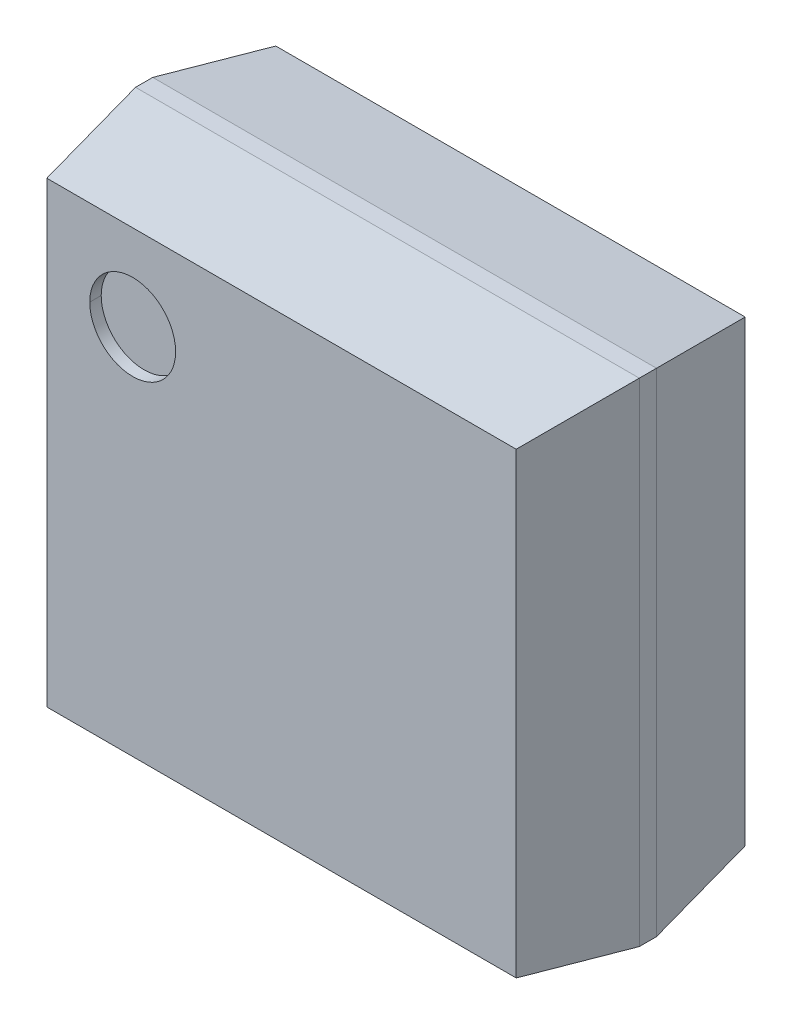
ISO-10303-21;
HEADER;
FILE_DESCRIPTION(('STEP AP214'),'2;1');
FILE_NAME('part.step','',(''),(''),'','','');
FILE_SCHEMA(('AUTOMOTIVE_DESIGN { 1 0 10303 214 1 1 1 1 }'));
ENDSEC;
DATA;
#1=APPLICATION_CONTEXT('core data for automotive mechanical design processes');
#2=APPLICATION_PROTOCOL_DEFINITION('international standard','automotive_design',2000,#1);
#3=PRODUCT_CONTEXT('',#1,'mechanical');
#4=PRODUCT('Part','Part','',(#3));
#5=PRODUCT_RELATED_PRODUCT_CATEGORY('part','',(#4));
#6=PRODUCT_DEFINITION_FORMATION('','',#4);
#7=PRODUCT_DEFINITION_CONTEXT('part definition',#1,'design');
#8=PRODUCT_DEFINITION('design','',#6,#7);
#9=PRODUCT_DEFINITION_SHAPE('','',#8);
#10=(LENGTH_UNIT() NAMED_UNIT(*) SI_UNIT(.MILLI.,.METRE.));
#11=(NAMED_UNIT(*) PLANE_ANGLE_UNIT() SI_UNIT($,.RADIAN.));
#12=(NAMED_UNIT(*) SI_UNIT($,.STERADIAN.) SOLID_ANGLE_UNIT());
#13=UNCERTAINTY_MEASURE_WITH_UNIT(LENGTH_MEASURE(1.E-05),#10,'distance_accuracy_value','');
#14=(GEOMETRIC_REPRESENTATION_CONTEXT(3) GLOBAL_UNCERTAINTY_ASSIGNED_CONTEXT((#13)) GLOBAL_UNIT_ASSIGNED_CONTEXT((#10,
#11,#12)) REPRESENTATION_CONTEXT('',''));
#15=CARTESIAN_POINT('',(0.,0.,0.));
#16=DIRECTION('',(0.,0.,1.));
#17=DIRECTION('',(1.,0.,0.));
#18=AXIS2_PLACEMENT_3D('',#15,#16,#17);
#19=CARTESIAN_POINT('',(0.,0.,2.));
#20=DIRECTION('',(0.,0.,1.));
#21=DIRECTION('',(1.,0.,0.));
#22=AXIS2_PLACEMENT_3D('',#19,#20,#21);
#23=PLANE('',#22);
#24=CARTESIAN_POINT('',(-1.3,1.25,2.));
#25=DIRECTION('',(0.,0.,1.));
#26=DIRECTION('',(1.,0.,0.));
#27=AXIS2_PLACEMENT_3D('',#24,#25,#26);
#28=CIRCLE('',#27,0.375);
#29=CARTESIAN_POINT('',(-0.925,1.25,2.));
#30=VERTEX_POINT('',#29);
#31=CARTESIAN_POINT('',(-1.675,1.25,2.));
#32=VERTEX_POINT('',#31);
#33=EDGE_CURVE('E11',#30,#32,#28,.T.);
#34=ORIENTED_EDGE('',*,*,#33,.T.);
#35=CARTESIAN_POINT('',(-1.3,1.25,2.));
#36=DIRECTION('',(0.,0.,1.));
#37=DIRECTION('',(1.,0.,0.));
#38=AXIS2_PLACEMENT_3D('',#35,#36,#37);
#39=CIRCLE('',#38,0.375);
#40=EDGE_CURVE('E228',#32,#30,#39,.T.);
#41=ORIENTED_EDGE('',*,*,#40,.T.);
#42=EDGE_LOOP('',(#34,#41));
#43=FACE_BOUND('',#42,.T.);
#44=ADVANCED_FACE('F16',(#43),#23,.T.);
#45=CARTESIAN_POINT('',(-1.3,1.25,2.1));
#46=DIRECTION('',(0.,0.,1.));
#47=DIRECTION('',(1.,0.,0.));
#48=AXIS2_PLACEMENT_3D('',#45,#46,#47);
#49=CYLINDRICAL_SURFACE('',#48,0.375);
#50=DIRECTION('',(0.,0.,1.));
#51=VECTOR('',#50,1.);
#52=CARTESIAN_POINT('',(-1.675,1.25,2.1));
#53=LINE('',#52,#51);
#54=CARTESIAN_POINT('',(-1.675,1.25,2.1));
#55=VERTEX_POINT('',#54);
#56=EDGE_CURVE('E232',#32,#55,#53,.T.);
#57=ORIENTED_EDGE('',*,*,#56,.F.);
#58=ORIENTED_EDGE('',*,*,#33,.F.);
#59=DIRECTION('',(0.,0.,1.));
#60=VECTOR('',#59,1.);
#61=CARTESIAN_POINT('',(-0.925,1.25,2.1));
#62=LINE('',#61,#60);
#63=CARTESIAN_POINT('',(-0.925,1.25,2.1));
#64=VERTEX_POINT('',#63);
#65=EDGE_CURVE('E193',#30,#64,#62,.T.);
#66=ORIENTED_EDGE('',*,*,#65,.T.);
#67=CARTESIAN_POINT('',(-1.3,1.25,2.1));
#68=DIRECTION('',(0.,0.,-1.));
#69=DIRECTION('',(1.,0.,0.));
#70=AXIS2_PLACEMENT_3D('',#67,#68,#69);
#71=CIRCLE('',#70,0.375);
#72=EDGE_CURVE('E27',#55,#64,#71,.T.);
#73=ORIENTED_EDGE('',*,*,#72,.F.);
#74=EDGE_LOOP('',(#57,#58,#66,#73));
#75=FACE_BOUND('',#74,.T.);
#76=ADVANCED_FACE('F277',(#75),#49,.F.);
#77=CARTESIAN_POINT('',(0.,0.,2.1));
#78=DIRECTION('',(0.,0.,1.));
#79=DIRECTION('',(1.,0.,0.));
#80=AXIS2_PLACEMENT_3D('',#77,#78,#79);
#81=PLANE('',#80);
#82=CARTESIAN_POINT('',(-1.3,1.25,2.1));
#83=DIRECTION('',(0.,0.,-1.));
#84=DIRECTION('',(1.,0.,0.));
#85=AXIS2_PLACEMENT_3D('',#82,#83,#84);
#86=CIRCLE('',#85,0.375);
#87=EDGE_CURVE('E241',#64,#55,#86,.T.);
#88=ORIENTED_EDGE('',*,*,#87,.T.);
#89=ORIENTED_EDGE('',*,*,#72,.T.);
#90=EDGE_LOOP('',(#88,#89));
#91=FACE_BOUND('',#90,.T.);
#92=DIRECTION('',(1.,0.,0.));
#93=VECTOR('',#92,1.);
#94=CARTESIAN_POINT('',(2.2,-2.,2.1));
#95=LINE('',#94,#93);
#96=CARTESIAN_POINT('',(-2.05,-2.,2.1));
#97=VERTEX_POINT('',#96);
#98=CARTESIAN_POINT('',(2.05,-2.,2.1));
#99=VERTEX_POINT('',#98);
#100=EDGE_CURVE('E216',#97,#99,#95,.T.);
#101=ORIENTED_EDGE('',*,*,#100,.T.);
#102=DIRECTION('',(0.,1.,0.));
#103=VECTOR('',#102,1.);
#104=CARTESIAN_POINT('',(2.05,-2.15,2.1));
#105=LINE('',#104,#103);
#106=CARTESIAN_POINT('',(2.05,2.,2.1));
#107=VERTEX_POINT('',#106);
#108=EDGE_CURVE('E96',#99,#107,#105,.T.);
#109=ORIENTED_EDGE('',*,*,#108,.T.);
#110=DIRECTION('',(-1.,0.,0.));
#111=VECTOR('',#110,1.);
#112=CARTESIAN_POINT('',(2.2,2.,2.1));
#113=LINE('',#112,#111);
#114=CARTESIAN_POINT('',(-2.05,2.,2.1));
#115=VERTEX_POINT('',#114);
#116=EDGE_CURVE('E201',#107,#115,#113,.T.);
#117=ORIENTED_EDGE('',*,*,#116,.T.);
#118=DIRECTION('',(0.,-1.,0.));
#119=VECTOR('',#118,1.);
#120=CARTESIAN_POINT('',(-2.05,-2.15,2.1));
#121=LINE('',#120,#119);
#122=EDGE_CURVE('E41',#115,#97,#121,.T.);
#123=ORIENTED_EDGE('',*,*,#122,.T.);
#124=EDGE_LOOP('',(#101,#109,#117,#123));
#125=FACE_BOUND('',#124,.T.);
#126=ADVANCED_FACE('F281',(#91,#125),#81,.T.);
#127=CARTESIAN_POINT('',(-2.125,-2.15,1.6375));
#128=DIRECTION('',(0.987105477747585,0.,-0.160071158553662));
#129=DIRECTION('',(0.,-1.,0.));
#130=AXIS2_PLACEMENT_3D('',#127,#128,#129);
#131=PLANE('',#130);
#132=DIRECTION('',(0.,1.,0.));
#133=VECTOR('',#132,1.);
#134=CARTESIAN_POINT('',(-2.2,0.,1.175));
#135=LINE('',#134,#133);
#136=CARTESIAN_POINT('',(-2.2,-2.15,1.175));
#137=VERTEX_POINT('',#136);
#138=CARTESIAN_POINT('',(-2.2,2.15,1.175));
#139=VERTEX_POINT('',#138);
#140=EDGE_CURVE('E233',#137,#139,#135,.T.);
#141=ORIENTED_EDGE('',*,*,#140,.F.);
#142=DIRECTION('',(0.15805901093215,0.158059010932149,0.97469723408159));
#143=VECTOR('',#142,1.);
#144=CARTESIAN_POINT('',(-2.2,-2.15,1.175));
#145=LINE('',#144,#143);
#146=EDGE_CURVE('E108',#137,#97,#145,.T.);
#147=ORIENTED_EDGE('',*,*,#146,.T.);
#148=ORIENTED_EDGE('',*,*,#122,.F.);
#149=DIRECTION('',(-0.15805901093215,0.15805901093215,-0.97469723408159));
#150=VECTOR('',#149,1.);
#151=CARTESIAN_POINT('',(-2.05,2.,2.1));
#152=LINE('',#151,#150);
#153=EDGE_CURVE('E200',#115,#139,#152,.T.);
#154=ORIENTED_EDGE('',*,*,#153,.T.);
#155=EDGE_LOOP('',(#141,#147,#148,#154));
#156=FACE_BOUND('',#155,.T.);
#157=ADVANCED_FACE('F18',(#156),#131,.F.);
#158=CARTESIAN_POINT('',(2.2,-2.075,1.6375));
#159=DIRECTION('',(0.,0.987105477747585,-0.160071158553662));
#160=DIRECTION('',(-1.,0.,0.));
#161=AXIS2_PLACEMENT_3D('',#158,#159,#160);
#162=PLANE('',#161);
#163=DIRECTION('',(-1.,0.,0.));
#164=VECTOR('',#163,1.);
#165=CARTESIAN_POINT('',(0.,-2.15,1.175));
#166=LINE('',#165,#164);
#167=CARTESIAN_POINT('',(2.2,-2.15,1.175));
#168=VERTEX_POINT('',#167);
#169=EDGE_CURVE('E254',#168,#137,#166,.T.);
#170=ORIENTED_EDGE('',*,*,#169,.F.);
#171=DIRECTION('',(-0.158059010932149,0.15805901093215,0.97469723408159));
#172=VECTOR('',#171,1.);
#173=CARTESIAN_POINT('',(2.2,-2.15,1.175));
#174=LINE('',#173,#172);
#175=EDGE_CURVE('E212',#168,#99,#174,.T.);
#176=ORIENTED_EDGE('',*,*,#175,.T.);
#177=ORIENTED_EDGE('',*,*,#100,.F.);
#178=ORIENTED_EDGE('',*,*,#146,.F.);
#179=EDGE_LOOP('',(#170,#176,#177,#178));
#180=FACE_BOUND('',#179,.T.);
#181=ADVANCED_FACE('F284',(#180),#162,.F.);
#182=CARTESIAN_POINT('',(2.125,-2.15,1.6375));
#183=DIRECTION('',(-0.987105477747585,0.,-0.160071158553662));
#184=DIRECTION('',(-0.160071158553662,0.,0.987105477747585));
#185=AXIS2_PLACEMENT_3D('',#182,#183,#184);
#186=PLANE('',#185);
#187=ORIENTED_EDGE('',*,*,#108,.F.);
#188=ORIENTED_EDGE('',*,*,#175,.F.);
#189=DIRECTION('',(0.,-1.,0.));
#190=VECTOR('',#189,1.);
#191=CARTESIAN_POINT('',(2.2,0.,1.175));
#192=LINE('',#191,#190);
#193=CARTESIAN_POINT('',(2.2,2.15,1.175));
#194=VERTEX_POINT('',#193);
#195=EDGE_CURVE('E219',#194,#168,#192,.T.);
#196=ORIENTED_EDGE('',*,*,#195,.F.);
#197=DIRECTION('',(-0.15805901093215,-0.15805901093215,0.97469723408159));
#198=VECTOR('',#197,1.);
#199=CARTESIAN_POINT('',(2.2,2.15,1.175));
#200=LINE('',#199,#198);
#201=EDGE_CURVE('E198',#194,#107,#200,.T.);
#202=ORIENTED_EDGE('',*,*,#201,.T.);
#203=EDGE_LOOP('',(#187,#188,#196,#202));
#204=FACE_BOUND('',#203,.T.);
#205=ADVANCED_FACE('F287',(#204),#186,.F.);
#206=CARTESIAN_POINT('',(2.2,2.075,1.6375));
#207=DIRECTION('',(0.,-0.987105477747585,-0.160071158553662));
#208=DIRECTION('',(0.,0.160071158553662,-0.987105477747585));
#209=AXIS2_PLACEMENT_3D('',#206,#207,#208);
#210=PLANE('',#209);
#211=ORIENTED_EDGE('',*,*,#116,.F.);
#212=ORIENTED_EDGE('',*,*,#201,.F.);
#213=DIRECTION('',(1.,0.,0.));
#214=VECTOR('',#213,1.);
#215=CARTESIAN_POINT('',(0.,2.15,1.175));
#216=LINE('',#215,#214);
#217=EDGE_CURVE('E227',#139,#194,#216,.T.);
#218=ORIENTED_EDGE('',*,*,#217,.F.);
#219=ORIENTED_EDGE('',*,*,#153,.F.);
#220=EDGE_LOOP('',(#211,#212,#218,#219));
#221=FACE_BOUND('',#220,.T.);
#222=ADVANCED_FACE('F294',(#221),#210,.F.);
#223=CARTESIAN_POINT('',(-2.2,0.,1.1));
#224=DIRECTION('',(-1.,0.,0.));
#225=DIRECTION('',(0.,0.,1.));
#226=AXIS2_PLACEMENT_3D('',#223,#224,#225);
#227=PLANE('',#226);
#228=DIRECTION('',(0.,-1.,0.));
#229=VECTOR('',#228,1.);
#230=CARTESIAN_POINT('',(-2.2,-2.15,1.025));
#231=LINE('',#230,#229);
#232=CARTESIAN_POINT('',(-2.2,2.15,1.025));
#233=VERTEX_POINT('',#232);
#234=CARTESIAN_POINT('',(-2.2,-2.15,1.025));
#235=VERTEX_POINT('',#234);
#236=EDGE_CURVE('E174',#233,#235,#231,.T.);
#237=ORIENTED_EDGE('',*,*,#236,.T.);
#238=DIRECTION('',(0.,0.,-1.));
#239=VECTOR('',#238,1.);
#240=CARTESIAN_POINT('',(-2.2,-2.15,1.1));
#241=LINE('',#240,#239);
#242=EDGE_CURVE('E127',#137,#235,#241,.T.);
#243=ORIENTED_EDGE('',*,*,#242,.F.);
#244=ORIENTED_EDGE('',*,*,#140,.T.);
#245=DIRECTION('',(0.,0.,1.));
#246=VECTOR('',#245,1.);
#247=CARTESIAN_POINT('',(-2.2,2.15,1.1));
#248=LINE('',#247,#246);
#249=EDGE_CURVE('E223',#233,#139,#248,.T.);
#250=ORIENTED_EDGE('',*,*,#249,.F.);
#251=EDGE_LOOP('',(#237,#243,#244,#250));
#252=FACE_BOUND('',#251,.T.);
#253=ADVANCED_FACE('F297',(#252),#227,.T.);
#254=CARTESIAN_POINT('',(0.,-2.15,1.1));
#255=DIRECTION('',(0.,-1.,0.));
#256=DIRECTION('',(-1.,0.,0.));
#257=AXIS2_PLACEMENT_3D('',#254,#255,#256);
#258=PLANE('',#257);
#259=DIRECTION('',(1.,0.,0.));
#260=VECTOR('',#259,1.);
#261=CARTESIAN_POINT('',(2.2,-2.15,1.025));
#262=LINE('',#261,#260);
#263=CARTESIAN_POINT('',(2.2,-2.15,1.025));
#264=VERTEX_POINT('',#263);
#265=EDGE_CURVE('E172',#235,#264,#262,.T.);
#266=ORIENTED_EDGE('',*,*,#265,.T.);
#267=DIRECTION('',(0.,0.,-1.));
#268=VECTOR('',#267,1.);
#269=CARTESIAN_POINT('',(2.2,-2.15,1.1));
#270=LINE('',#269,#268);
#271=EDGE_CURVE('E142',#168,#264,#270,.T.);
#272=ORIENTED_EDGE('',*,*,#271,.F.);
#273=ORIENTED_EDGE('',*,*,#169,.T.);
#274=ORIENTED_EDGE('',*,*,#242,.T.);
#275=EDGE_LOOP('',(#266,#272,#273,#274));
#276=FACE_BOUND('',#275,.T.);
#277=ADVANCED_FACE('F298',(#276),#258,.T.);
#278=CARTESIAN_POINT('',(2.2,0.,1.1));
#279=DIRECTION('',(1.,0.,0.));
#280=DIRECTION('',(0.,1.,0.));
#281=AXIS2_PLACEMENT_3D('',#278,#279,#280);
#282=PLANE('',#281);
#283=DIRECTION('',(0.,1.,0.));
#284=VECTOR('',#283,1.);
#285=CARTESIAN_POINT('',(2.2,-2.15,1.025));
#286=LINE('',#285,#284);
#287=CARTESIAN_POINT('',(2.2,2.15,1.025));
#288=VERTEX_POINT('',#287);
#289=EDGE_CURVE('E206',#264,#288,#286,.T.);
#290=ORIENTED_EDGE('',*,*,#289,.T.);
#291=DIRECTION('',(0.,0.,-1.));
#292=VECTOR('',#291,1.);
#293=CARTESIAN_POINT('',(2.2,2.15,1.1));
#294=LINE('',#293,#292);
#295=EDGE_CURVE('E222',#194,#288,#294,.T.);
#296=ORIENTED_EDGE('',*,*,#295,.F.);
#297=ORIENTED_EDGE('',*,*,#195,.T.);
#298=ORIENTED_EDGE('',*,*,#271,.T.);
#299=EDGE_LOOP('',(#290,#296,#297,#298));
#300=FACE_BOUND('',#299,.T.);
#301=ADVANCED_FACE('F299',(#300),#282,.T.);
#302=CARTESIAN_POINT('',(0.,2.15,1.1));
#303=DIRECTION('',(0.,1.,0.));
#304=DIRECTION('',(1.,0.,0.));
#305=AXIS2_PLACEMENT_3D('',#302,#303,#304);
#306=PLANE('',#305);
#307=DIRECTION('',(-1.,0.,0.));
#308=VECTOR('',#307,1.);
#309=CARTESIAN_POINT('',(2.2,2.15,1.025));
#310=LINE('',#309,#308);
#311=EDGE_CURVE('E207',#288,#233,#310,.T.);
#312=ORIENTED_EDGE('',*,*,#311,.T.);
#313=ORIENTED_EDGE('',*,*,#249,.T.);
#314=ORIENTED_EDGE('',*,*,#217,.T.);
#315=ORIENTED_EDGE('',*,*,#295,.T.);
#316=EDGE_LOOP('',(#312,#313,#314,#315));
#317=FACE_BOUND('',#316,.T.);
#318=ADVANCED_FACE('F301',(#317),#306,.T.);
#319=CARTESIAN_POINT('',(-2.125,-2.15,0.5625));
#320=DIRECTION('',(0.987105477747585,0.,0.160071158553662));
#321=DIRECTION('',(0.,-1.,0.));
#322=AXIS2_PLACEMENT_3D('',#319,#320,#321);
#323=PLANE('',#322);
#324=DIRECTION('',(0.,-1.,0.));
#325=VECTOR('',#324,1.);
#326=CARTESIAN_POINT('',(-2.05,0.,0.1));
#327=LINE('',#326,#325);
#328=CARTESIAN_POINT('',(-2.05,2.,0.1));
#329=VERTEX_POINT('',#328);
#330=CARTESIAN_POINT('',(-2.05,-2.,0.1));
#331=VERTEX_POINT('',#330);
#332=EDGE_CURVE('E177',#329,#331,#327,.T.);
#333=ORIENTED_EDGE('',*,*,#332,.T.);
#334=DIRECTION('',(-0.158059010932151,-0.158059010932149,0.97469723408159));
#335=VECTOR('',#334,1.);
#336=CARTESIAN_POINT('',(-2.05,-2.,0.1));
#337=LINE('',#336,#335);
#338=EDGE_CURVE('E167',#331,#235,#337,.T.);
#339=ORIENTED_EDGE('',*,*,#338,.T.);
#340=ORIENTED_EDGE('',*,*,#236,.F.);
#341=DIRECTION('',(0.158059010932148,-0.158059010932149,-0.97469723408159));
#342=VECTOR('',#341,1.);
#343=CARTESIAN_POINT('',(-2.2,2.15,1.025));
#344=LINE('',#343,#342);
#345=EDGE_CURVE('E155',#233,#329,#344,.T.);
#346=ORIENTED_EDGE('',*,*,#345,.T.);
#347=EDGE_LOOP('',(#333,#339,#340,#346));
#348=FACE_BOUND('',#347,.T.);
#349=ADVANCED_FACE('F178',(#348),#323,.F.);
#350=CARTESIAN_POINT('',(2.2,-2.075,0.5625));
#351=DIRECTION('',(0.,0.987105477747585,0.160071158553662));
#352=DIRECTION('',(1.,0.,0.));
#353=AXIS2_PLACEMENT_3D('',#350,#351,#352);
#354=PLANE('',#353);
#355=DIRECTION('',(0.15805901093215,-0.15805901093215,0.97469723408159));
#356=VECTOR('',#355,1.);
#357=CARTESIAN_POINT('',(2.05,-2.,0.1));
#358=LINE('',#357,#356);
#359=CARTESIAN_POINT('',(2.05,-2.,0.1));
#360=VERTEX_POINT('',#359);
#361=EDGE_CURVE('E20',#360,#264,#358,.T.);
#362=ORIENTED_EDGE('',*,*,#361,.T.);
#363=ORIENTED_EDGE('',*,*,#265,.F.);
#364=ORIENTED_EDGE('',*,*,#338,.F.);
#365=DIRECTION('',(1.,0.,0.));
#366=VECTOR('',#365,1.);
#367=CARTESIAN_POINT('',(0.,-2.,0.1));
#368=LINE('',#367,#366);
#369=EDGE_CURVE('E170',#331,#360,#368,.T.);
#370=ORIENTED_EDGE('',*,*,#369,.T.);
#371=EDGE_LOOP('',(#362,#363,#364,#370));
#372=FACE_BOUND('',#371,.T.);
#373=ADVANCED_FACE('F168',(#372),#354,.F.);
#374=CARTESIAN_POINT('',(2.125,-2.15,0.5625));
#375=DIRECTION('',(-0.987105477747585,0.,0.160071158553662));
#376=DIRECTION('',(0.,1.,0.));
#377=AXIS2_PLACEMENT_3D('',#374,#375,#376);
#378=PLANE('',#377);
#379=ORIENTED_EDGE('',*,*,#289,.F.);
#380=ORIENTED_EDGE('',*,*,#361,.F.);
#381=DIRECTION('',(0.,1.,0.));
#382=VECTOR('',#381,1.);
#383=CARTESIAN_POINT('',(2.05,0.,0.1));
#384=LINE('',#383,#382);
#385=CARTESIAN_POINT('',(2.05,2.,0.1));
#386=VERTEX_POINT('',#385);
#387=EDGE_CURVE('E185',#360,#386,#384,.T.);
#388=ORIENTED_EDGE('',*,*,#387,.T.);
#389=DIRECTION('',(0.158059010932151,0.158059010932149,0.97469723408159));
#390=VECTOR('',#389,1.);
#391=CARTESIAN_POINT('',(2.05,2.,0.1));
#392=LINE('',#391,#390);
#393=EDGE_CURVE('E202',#386,#288,#392,.T.);
#394=ORIENTED_EDGE('',*,*,#393,.T.);
#395=EDGE_LOOP('',(#379,#380,#388,#394));
#396=FACE_BOUND('',#395,.T.);
#397=ADVANCED_FACE('F305',(#396),#378,.F.);
#398=CARTESIAN_POINT('',(2.2,2.075,0.5625));
#399=DIRECTION('',(0.,-0.987105477747585,0.160071158553662));
#400=DIRECTION('',(-1.,0.,0.));
#401=AXIS2_PLACEMENT_3D('',#398,#399,#400);
#402=PLANE('',#401);
#403=DIRECTION('',(-1.,0.,0.));
#404=VECTOR('',#403,1.);
#405=CARTESIAN_POINT('',(0.,2.,0.1));
#406=LINE('',#405,#404);
#407=EDGE_CURVE('E182',#386,#329,#406,.T.);
#408=ORIENTED_EDGE('',*,*,#407,.T.);
#409=ORIENTED_EDGE('',*,*,#345,.F.);
#410=ORIENTED_EDGE('',*,*,#311,.F.);
#411=ORIENTED_EDGE('',*,*,#393,.F.);
#412=EDGE_LOOP('',(#408,#409,#410,#411));
#413=FACE_BOUND('',#412,.T.);
#414=ADVANCED_FACE('F304',(#413),#402,.F.);
#415=CARTESIAN_POINT('',(0.,0.,0.1));
#416=DIRECTION('',(0.,0.,1.));
#417=DIRECTION('',(1.,0.,0.));
#418=AXIS2_PLACEMENT_3D('',#415,#416,#417);
#419=PLANE('',#418);
#420=ORIENTED_EDGE('',*,*,#387,.F.);
#421=ORIENTED_EDGE('',*,*,#369,.F.);
#422=ORIENTED_EDGE('',*,*,#332,.F.);
#423=ORIENTED_EDGE('',*,*,#407,.F.);
#424=EDGE_LOOP('',(#420,#421,#422,#423));
#425=FACE_BOUND('',#424,.T.);
#426=ADVANCED_FACE('F184',(#425),#419,.F.);
#427=CARTESIAN_POINT('',(-1.3,1.25,2.1));
#428=DIRECTION('',(0.,0.,1.));
#429=DIRECTION('',(1.,0.,0.));
#430=AXIS2_PLACEMENT_3D('',#427,#428,#429);
#431=CYLINDRICAL_SURFACE('',#430,0.375);
#432=ORIENTED_EDGE('',*,*,#40,.F.);
#433=ORIENTED_EDGE('',*,*,#56,.T.);
#434=ORIENTED_EDGE('',*,*,#87,.F.);
#435=ORIENTED_EDGE('',*,*,#65,.F.);
#436=EDGE_LOOP('',(#432,#433,#434,#435));
#437=FACE_BOUND('',#436,.T.);
#438=ADVANCED_FACE('F280',(#437),#431,.F.);
#439=CLOSED_SHELL('',(#44,#76,#126,#157,#181,#205,#222,#253,#277,#301,#318,#349,#373,#397,#414,
#426,#438));
#440=MANIFOLD_SOLID_BREP('B1',#439);
#441=ADVANCED_BREP_SHAPE_REPRESENTATION('',(#18,#440),#14);
#442=SHAPE_DEFINITION_REPRESENTATION(#9,#441);
ENDSEC;
END-ISO-10303-21;
